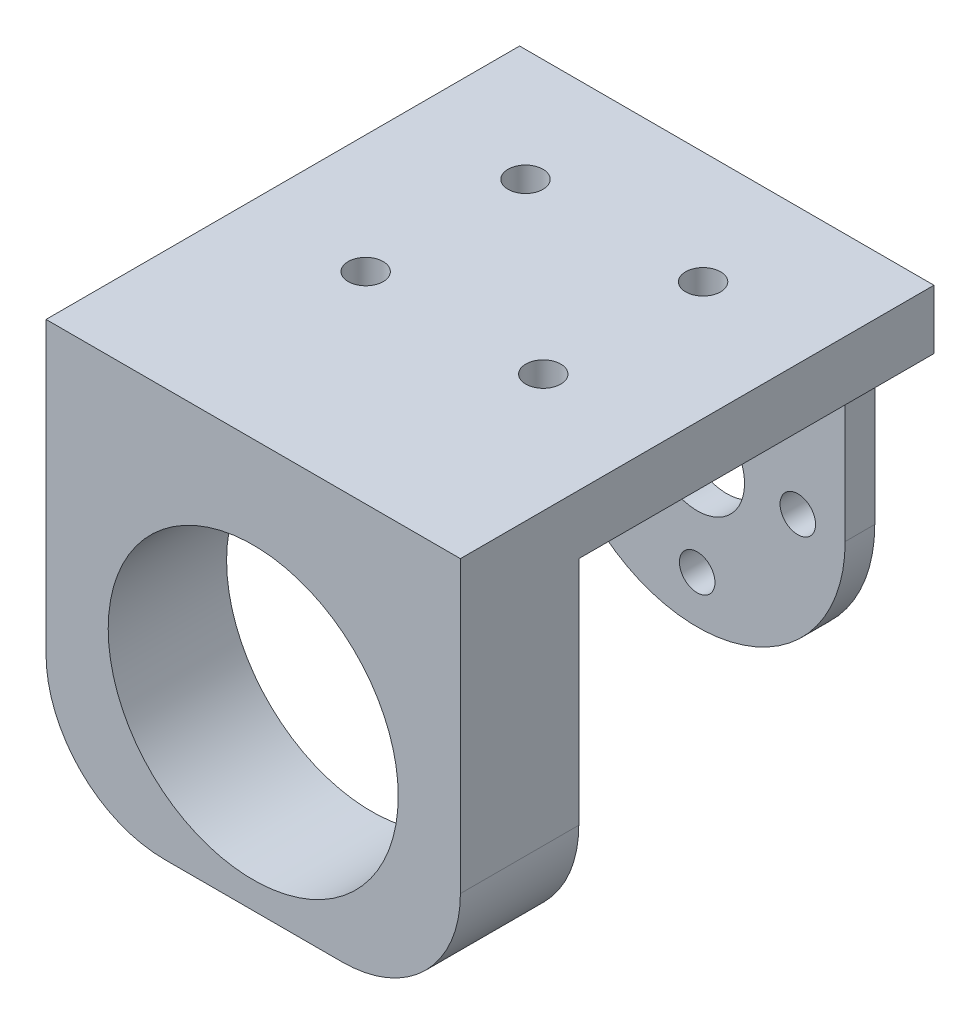
ISO-10303-21;
HEADER;
FILE_DESCRIPTION(('STEP AP214'),'2;1');
FILE_NAME('part.step','',(''),(''),'','','');
FILE_SCHEMA(('AUTOMOTIVE_DESIGN { 1 0 10303 214 1 1 1 1 }'));
ENDSEC;
DATA;
#1=APPLICATION_CONTEXT('core data for automotive mechanical design processes');
#2=APPLICATION_PROTOCOL_DEFINITION('international standard','automotive_design',2000,#1);
#3=PRODUCT_CONTEXT('',#1,'mechanical');
#4=PRODUCT('Part','Part','',(#3));
#5=PRODUCT_RELATED_PRODUCT_CATEGORY('part','',(#4));
#6=PRODUCT_DEFINITION_FORMATION('','',#4);
#7=PRODUCT_DEFINITION_CONTEXT('part definition',#1,'design');
#8=PRODUCT_DEFINITION('design','',#6,#7);
#9=PRODUCT_DEFINITION_SHAPE('','',#8);
#10=(LENGTH_UNIT() NAMED_UNIT(*) SI_UNIT(.MILLI.,.METRE.));
#11=(NAMED_UNIT(*) PLANE_ANGLE_UNIT() SI_UNIT($,.RADIAN.));
#12=(NAMED_UNIT(*) SI_UNIT($,.STERADIAN.) SOLID_ANGLE_UNIT());
#13=UNCERTAINTY_MEASURE_WITH_UNIT(LENGTH_MEASURE(1.E-05),#10,'distance_accuracy_value','');
#14=(GEOMETRIC_REPRESENTATION_CONTEXT(3) GLOBAL_UNCERTAINTY_ASSIGNED_CONTEXT((#13)) GLOBAL_UNIT_ASSIGNED_CONTEXT((#10,
#11,#12)) REPRESENTATION_CONTEXT('',''));
#15=CARTESIAN_POINT('',(0.,0.,0.));
#16=DIRECTION('',(0.,0.,1.));
#17=DIRECTION('',(1.,0.,0.));
#18=AXIS2_PLACEMENT_3D('',#15,#16,#17);
#19=CARTESIAN_POINT('',(-17.5,0.,40.));
#20=DIRECTION('',(-1.,0.,0.));
#21=DIRECTION('',(0.,0.,1.));
#22=AXIS2_PLACEMENT_3D('',#19,#20,#21);
#23=PLANE('',#22);
#24=DIRECTION('',(0.,1.,0.));
#25=VECTOR('',#24,1.);
#26=CARTESIAN_POINT('',(-17.5,-14.5,30.));
#27=LINE('',#26,#25);
#28=CARTESIAN_POINT('',(-17.5,-4.49999999999992,30.));
#29=VERTEX_POINT('',#28);
#30=CARTESIAN_POINT('',(-17.5,15.,30.));
#31=VERTEX_POINT('',#30);
#32=EDGE_CURVE('E160',#29,#31,#27,.T.);
#33=ORIENTED_EDGE('',*,*,#32,.F.);
#34=DIRECTION('',(0.,0.,-1.));
#35=VECTOR('',#34,1.);
#36=CARTESIAN_POINT('',(-17.5,-4.49999999999992,59.5));
#37=LINE('',#36,#35);
#38=CARTESIAN_POINT('',(-17.5,-4.49999999999992,40.));
#39=VERTEX_POINT('',#38);
#40=EDGE_CURVE('E146',#39,#29,#37,.T.);
#41=ORIENTED_EDGE('',*,*,#40,.F.);
#42=DIRECTION('',(0.,1.,0.));
#43=VECTOR('',#42,1.);
#44=CARTESIAN_POINT('',(-17.5,0.,40.));
#45=LINE('',#44,#43);
#46=CARTESIAN_POINT('',(-17.5,20.,40.));
#47=VERTEX_POINT('',#46);
#48=EDGE_CURVE('E186',#39,#47,#45,.T.);
#49=ORIENTED_EDGE('',*,*,#48,.T.);
#50=DIRECTION('',(0.,0.,-1.));
#51=VECTOR('',#50,1.);
#52=CARTESIAN_POINT('',(-17.5,20.,40.));
#53=LINE('',#52,#51);
#54=CARTESIAN_POINT('',(-17.5,20.,0.));
#55=VERTEX_POINT('',#54);
#56=EDGE_CURVE('E197',#47,#55,#53,.T.);
#57=ORIENTED_EDGE('',*,*,#56,.T.);
#58=DIRECTION('',(0.,1.,0.));
#59=VECTOR('',#58,1.);
#60=CARTESIAN_POINT('',(-17.5,0.,0.));
#61=LINE('',#60,#59);
#62=CARTESIAN_POINT('',(-17.5,15.,0.));
#63=VERTEX_POINT('',#62);
#64=EDGE_CURVE('E184',#63,#55,#61,.T.);
#65=ORIENTED_EDGE('',*,*,#64,.F.);
#66=DIRECTION('',(0.,0.,-1.));
#67=VECTOR('',#66,1.);
#68=CARTESIAN_POINT('',(-17.5,15.,40.));
#69=LINE('',#68,#67);
#70=EDGE_CURVE('E169',#31,#63,#69,.T.);
#71=ORIENTED_EDGE('',*,*,#70,.F.);
#72=EDGE_LOOP('',(#33,#41,#49,#57,#65,#71));
#73=FACE_BOUND('',#72,.T.);
#74=ADVANCED_FACE('F58',(#73),#23,.T.);
#75=CARTESIAN_POINT('',(17.5,0.,40.));
#76=DIRECTION('',(-1.,0.,0.));
#77=DIRECTION('',(0.,0.,1.));
#78=AXIS2_PLACEMENT_3D('',#75,#76,#77);
#79=PLANE('',#78);
#80=DIRECTION('',(0.,0.,-1.));
#81=VECTOR('',#80,1.);
#82=CARTESIAN_POINT('',(17.5,-4.49999999999992,59.5));
#83=LINE('',#82,#81);
#84=CARTESIAN_POINT('',(17.5,-4.49999999999992,40.));
#85=VERTEX_POINT('',#84);
#86=CARTESIAN_POINT('',(17.5,-4.49999999999992,30.));
#87=VERTEX_POINT('',#86);
#88=EDGE_CURVE('E165',#85,#87,#83,.T.);
#89=ORIENTED_EDGE('',*,*,#88,.T.);
#90=DIRECTION('',(0.,1.,0.));
#91=VECTOR('',#90,1.);
#92=CARTESIAN_POINT('',(17.5,-14.5,30.));
#93=LINE('',#92,#91);
#94=CARTESIAN_POINT('',(17.5,15.,30.));
#95=VERTEX_POINT('',#94);
#96=EDGE_CURVE('E170',#87,#95,#93,.T.);
#97=ORIENTED_EDGE('',*,*,#96,.T.);
#98=DIRECTION('',(0.,0.,-1.));
#99=VECTOR('',#98,1.);
#100=CARTESIAN_POINT('',(17.5,15.,40.));
#101=LINE('',#100,#99);
#102=CARTESIAN_POINT('',(17.5,15.,0.));
#103=VERTEX_POINT('',#102);
#104=EDGE_CURVE('E202',#95,#103,#101,.T.);
#105=ORIENTED_EDGE('',*,*,#104,.T.);
#106=DIRECTION('',(0.,1.,0.));
#107=VECTOR('',#106,1.);
#108=CARTESIAN_POINT('',(17.5,0.,0.));
#109=LINE('',#108,#107);
#110=CARTESIAN_POINT('',(17.5,20.,0.));
#111=VERTEX_POINT('',#110);
#112=EDGE_CURVE('E173',#103,#111,#109,.T.);
#113=ORIENTED_EDGE('',*,*,#112,.T.);
#114=DIRECTION('',(0.,0.,-1.));
#115=VECTOR('',#114,1.);
#116=CARTESIAN_POINT('',(17.5,20.,40.));
#117=LINE('',#116,#115);
#118=CARTESIAN_POINT('',(17.5,20.,40.));
#119=VERTEX_POINT('',#118);
#120=EDGE_CURVE('E188',#119,#111,#117,.T.);
#121=ORIENTED_EDGE('',*,*,#120,.F.);
#122=DIRECTION('',(0.,1.,0.));
#123=VECTOR('',#122,1.);
#124=CARTESIAN_POINT('',(17.5,0.,40.));
#125=LINE('',#124,#123);
#126=EDGE_CURVE('E183',#85,#119,#125,.T.);
#127=ORIENTED_EDGE('',*,*,#126,.F.);
#128=EDGE_LOOP('',(#89,#97,#105,#113,#121,#127));
#129=FACE_BOUND('',#128,.T.);
#130=ADVANCED_FACE('F291',(#129),#79,.F.);
#131=CARTESIAN_POINT('',(0.,-14.5,0.));
#132=DIRECTION('',(0.,1.,0.));
#133=DIRECTION('',(0.,0.,1.));
#134=AXIS2_PLACEMENT_3D('',#131,#132,#133);
#135=PLANE('',#134);
#136=DIRECTION('',(1.,0.,0.));
#137=VECTOR('',#136,1.);
#138=CARTESIAN_POINT('',(-17.5,-14.5,30.));
#139=LINE('',#138,#137);
#140=CARTESIAN_POINT('',(-7.49999999999994,-14.5,30.));
#141=VERTEX_POINT('',#140);
#142=CARTESIAN_POINT('',(7.49999999999993,-14.5,30.));
#143=VERTEX_POINT('',#142);
#144=EDGE_CURVE('E164',#141,#143,#139,.T.);
#145=ORIENTED_EDGE('',*,*,#144,.T.);
#146=DIRECTION('',(0.,0.,-1.));
#147=VECTOR('',#146,1.);
#148=CARTESIAN_POINT('',(7.5,-14.5,59.5));
#149=LINE('',#148,#147);
#150=CARTESIAN_POINT('',(7.5,-14.5,40.));
#151=VERTEX_POINT('',#150);
#152=EDGE_CURVE('E12',#143,#151,#149,.F.);
#153=ORIENTED_EDGE('',*,*,#152,.T.);
#154=DIRECTION('',(1.,0.,0.));
#155=VECTOR('',#154,1.);
#156=CARTESIAN_POINT('',(-17.5,-14.5,40.));
#157=LINE('',#156,#155);
#158=CARTESIAN_POINT('',(-7.49999999999994,-14.5,40.));
#159=VERTEX_POINT('',#158);
#160=EDGE_CURVE('E171',#159,#151,#157,.T.);
#161=ORIENTED_EDGE('',*,*,#160,.F.);
#162=DIRECTION('',(0.,0.,-1.));
#163=VECTOR('',#162,1.);
#164=CARTESIAN_POINT('',(-7.50000000000001,-14.5,59.5));
#165=LINE('',#164,#163);
#166=EDGE_CURVE('E67',#141,#159,#165,.F.);
#167=ORIENTED_EDGE('',*,*,#166,.F.);
#168=EDGE_LOOP('',(#145,#153,#161,#167));
#169=FACE_BOUND('',#168,.T.);
#170=ADVANCED_FACE('F305',(#169),#135,.F.);
#171=CARTESIAN_POINT('',(0.,15.,40.));
#172=DIRECTION('',(0.,-1.,0.));
#173=DIRECTION('',(0.,0.,-1.));
#174=AXIS2_PLACEMENT_3D('',#171,#172,#173);
#175=PLANE('',#174);
#176=CARTESIAN_POINT('',(-7.50000000000001,15.,23.));
#177=DIRECTION('',(0.,-1.,0.));
#178=DIRECTION('',(0.,0.,-1.));
#179=AXIS2_PLACEMENT_3D('',#176,#177,#178);
#180=CIRCLE('',#179,1.475);
#181=CARTESIAN_POINT('',(-7.50000000000001,15.,21.525));
#182=VERTEX_POINT('',#181);
#183=EDGE_CURVE('E545',#182,#182,#180,.T.);
#184=ORIENTED_EDGE('',*,*,#183,.F.);
#185=EDGE_LOOP('',(#184));
#186=FACE_BOUND('',#185,.T.);
#187=CARTESIAN_POINT('',(-7.5,15.,9.5));
#188=DIRECTION('',(0.,-1.,0.));
#189=DIRECTION('',(0.,0.,-1.));
#190=AXIS2_PLACEMENT_3D('',#187,#188,#189);
#191=CIRCLE('',#190,1.475);
#192=CARTESIAN_POINT('',(-7.5,15.,8.025));
#193=VERTEX_POINT('',#192);
#194=EDGE_CURVE('E549',#193,#193,#191,.T.);
#195=ORIENTED_EDGE('',*,*,#194,.F.);
#196=EDGE_LOOP('',(#195));
#197=FACE_BOUND('',#196,.T.);
#198=CARTESIAN_POINT('',(7.5,15.,9.5));
#199=DIRECTION('',(0.,-1.,0.));
#200=DIRECTION('',(0.,0.,-1.));
#201=AXIS2_PLACEMENT_3D('',#198,#199,#200);
#202=CIRCLE('',#201,1.475);
#203=CARTESIAN_POINT('',(7.5,15.,8.025));
#204=VERTEX_POINT('',#203);
#205=EDGE_CURVE('E546',#204,#204,#202,.T.);
#206=ORIENTED_EDGE('',*,*,#205,.F.);
#207=EDGE_LOOP('',(#206));
#208=FACE_BOUND('',#207,.T.);
#209=CARTESIAN_POINT('',(7.5,15.,23.));
#210=DIRECTION('',(0.,-1.,0.));
#211=DIRECTION('',(0.,0.,-1.));
#212=AXIS2_PLACEMENT_3D('',#209,#210,#211);
#213=CIRCLE('',#212,1.475);
#214=CARTESIAN_POINT('',(7.5,15.,21.525));
#215=VERTEX_POINT('',#214);
#216=EDGE_CURVE('E246',#215,#215,#213,.T.);
#217=ORIENTED_EDGE('',*,*,#216,.F.);
#218=EDGE_LOOP('',(#217));
#219=FACE_BOUND('',#218,.T.);
#220=ORIENTED_EDGE('',*,*,#104,.F.);
#221=DIRECTION('',(1.,0.,0.));
#222=VECTOR('',#221,1.);
#223=CARTESIAN_POINT('',(-17.5,15.,30.));
#224=LINE('',#223,#222);
#225=EDGE_CURVE('E178',#31,#95,#224,.T.);
#226=ORIENTED_EDGE('',*,*,#225,.F.);
#227=ORIENTED_EDGE('',*,*,#70,.T.);
#228=DIRECTION('',(-1.,0.,0.));
#229=VECTOR('',#228,1.);
#230=CARTESIAN_POINT('',(0.,15.,0.));
#231=LINE('',#230,#229);
#232=CARTESIAN_POINT('',(-12.5,15.,0.));
#233=VERTEX_POINT('',#232);
#234=EDGE_CURVE('E191',#233,#63,#231,.T.);
#235=ORIENTED_EDGE('',*,*,#234,.F.);
#236=DIRECTION('',(0.,0.,-1.));
#237=VECTOR('',#236,1.);
#238=CARTESIAN_POINT('',(-12.5,15.,2.5));
#239=LINE('',#238,#237);
#240=CARTESIAN_POINT('',(-12.5,15.,2.5));
#241=VERTEX_POINT('',#240);
#242=EDGE_CURVE('E211',#241,#233,#239,.T.);
#243=ORIENTED_EDGE('',*,*,#242,.F.);
#244=DIRECTION('',(1.,0.,0.));
#245=VECTOR('',#244,1.);
#246=CARTESIAN_POINT('',(0.,15.,2.5));
#247=LINE('',#246,#245);
#248=CARTESIAN_POINT('',(12.5,15.,2.5));
#249=VERTEX_POINT('',#248);
#250=EDGE_CURVE('E200',#241,#249,#247,.T.);
#251=ORIENTED_EDGE('',*,*,#250,.T.);
#252=DIRECTION('',(0.,0.,-1.));
#253=VECTOR('',#252,1.);
#254=CARTESIAN_POINT('',(12.5,15.,2.5));
#255=LINE('',#254,#253);
#256=CARTESIAN_POINT('',(12.5,15.,0.));
#257=VERTEX_POINT('',#256);
#258=EDGE_CURVE('E208',#249,#257,#255,.T.);
#259=ORIENTED_EDGE('',*,*,#258,.T.);
#260=EDGE_CURVE('E192',#103,#257,#231,.T.);
#261=ORIENTED_EDGE('',*,*,#260,.F.);
#262=EDGE_LOOP('',(#220,#226,#227,#235,#243,#251,#259,#261));
#263=FACE_BOUND('',#262,.T.);
#264=ADVANCED_FACE('F285',(#186,#197,#208,#219,#263),#175,.T.);
#265=CARTESIAN_POINT('',(-12.5,0.,2.5));
#266=DIRECTION('',(1.,0.,0.));
#267=DIRECTION('',(0.,1.,0.));
#268=AXIS2_PLACEMENT_3D('',#265,#266,#267);
#269=PLANE('',#268);
#270=DIRECTION('',(0.,-1.,0.));
#271=VECTOR('',#270,1.);
#272=CARTESIAN_POINT('',(-12.5,0.,2.5));
#273=LINE('',#272,#271);
#274=CARTESIAN_POINT('',(-12.5,0.,2.5));
#275=VERTEX_POINT('',#274);
#276=EDGE_CURVE('E214',#241,#275,#273,.T.);
#277=ORIENTED_EDGE('',*,*,#276,.F.);
#278=ORIENTED_EDGE('',*,*,#242,.T.);
#279=DIRECTION('',(0.,-1.,0.));
#280=VECTOR('',#279,1.);
#281=CARTESIAN_POINT('',(-12.5,0.,0.));
#282=LINE('',#281,#280);
#283=CARTESIAN_POINT('',(-12.5,0.,0.));
#284=VERTEX_POINT('',#283);
#285=EDGE_CURVE('E213',#233,#284,#282,.T.);
#286=ORIENTED_EDGE('',*,*,#285,.T.);
#287=DIRECTION('',(0.,0.,-1.));
#288=VECTOR('',#287,1.);
#289=CARTESIAN_POINT('',(-12.5,0.,2.5));
#290=LINE('',#289,#288);
#291=EDGE_CURVE('E238',#275,#284,#290,.T.);
#292=ORIENTED_EDGE('',*,*,#291,.F.);
#293=EDGE_LOOP('',(#277,#278,#286,#292));
#294=FACE_BOUND('',#293,.T.);
#295=ADVANCED_FACE('F60',(#294),#269,.F.);
#296=CARTESIAN_POINT('',(0.,0.,2.5));
#297=DIRECTION('',(0.,0.,-1.));
#298=DIRECTION('',(-1.,0.,0.));
#299=AXIS2_PLACEMENT_3D('',#296,#297,#298);
#300=CYLINDRICAL_SURFACE('',#299,12.5);
#301=CARTESIAN_POINT('',(0.,0.,0.));
#302=DIRECTION('',(0.,0.,1.));
#303=DIRECTION('',(1.,0.,0.));
#304=AXIS2_PLACEMENT_3D('',#301,#302,#303);
#305=CIRCLE('',#304,12.5);
#306=CARTESIAN_POINT('',(12.5,0.,0.));
#307=VERTEX_POINT('',#306);
#308=EDGE_CURVE('E227',#284,#307,#305,.T.);
#309=ORIENTED_EDGE('',*,*,#308,.T.);
#310=DIRECTION('',(0.,0.,-1.));
#311=VECTOR('',#310,1.);
#312=CARTESIAN_POINT('',(12.5,0.,2.5));
#313=LINE('',#312,#311);
#314=CARTESIAN_POINT('',(12.5,0.,2.5));
#315=VERTEX_POINT('',#314);
#316=EDGE_CURVE('E225',#315,#307,#313,.T.);
#317=ORIENTED_EDGE('',*,*,#316,.F.);
#318=CARTESIAN_POINT('',(0.,0.,2.5));
#319=DIRECTION('',(0.,0.,1.));
#320=DIRECTION('',(1.,0.,0.));
#321=AXIS2_PLACEMENT_3D('',#318,#319,#320);
#322=CIRCLE('',#321,12.5);
#323=EDGE_CURVE('E216',#275,#315,#322,.T.);
#324=ORIENTED_EDGE('',*,*,#323,.F.);
#325=ORIENTED_EDGE('',*,*,#291,.T.);
#326=EDGE_LOOP('',(#309,#317,#324,#325));
#327=FACE_BOUND('',#326,.T.);
#328=ADVANCED_FACE('F346',(#327),#300,.T.);
#329=CARTESIAN_POINT('',(12.5,0.,2.5));
#330=DIRECTION('',(1.,0.,0.));
#331=DIRECTION('',(0.,1.,0.));
#332=AXIS2_PLACEMENT_3D('',#329,#330,#331);
#333=PLANE('',#332);
#334=ORIENTED_EDGE('',*,*,#258,.F.);
#335=DIRECTION('',(0.,-1.,0.));
#336=VECTOR('',#335,1.);
#337=CARTESIAN_POINT('',(12.5,0.,2.5));
#338=LINE('',#337,#336);
#339=EDGE_CURVE('E220',#249,#315,#338,.T.);
#340=ORIENTED_EDGE('',*,*,#339,.T.);
#341=ORIENTED_EDGE('',*,*,#316,.T.);
#342=DIRECTION('',(0.,-1.,0.));
#343=VECTOR('',#342,1.);
#344=CARTESIAN_POINT('',(12.5,0.,0.));
#345=LINE('',#344,#343);
#346=EDGE_CURVE('E230',#257,#307,#345,.T.);
#347=ORIENTED_EDGE('',*,*,#346,.F.);
#348=EDGE_LOOP('',(#334,#340,#341,#347));
#349=FACE_BOUND('',#348,.T.);
#350=ADVANCED_FACE('F343',(#349),#333,.T.);
#351=CARTESIAN_POINT('',(0.,20.,2.5));
#352=DIRECTION('',(0.,1.,0.));
#353=DIRECTION('',(0.,0.,1.));
#354=AXIS2_PLACEMENT_3D('',#351,#352,#353);
#355=PLANE('',#354);
#356=CARTESIAN_POINT('',(-7.50000000000001,20.,23.));
#357=DIRECTION('',(0.,1.,0.));
#358=DIRECTION('',(0.,0.,1.));
#359=AXIS2_PLACEMENT_3D('',#356,#357,#358);
#360=CIRCLE('',#359,1.475);
#361=CARTESIAN_POINT('',(-7.50000000000001,20.,24.475));
#362=VERTEX_POINT('',#361);
#363=EDGE_CURVE('E62',#362,#362,#360,.T.);
#364=ORIENTED_EDGE('',*,*,#363,.F.);
#365=EDGE_LOOP('',(#364));
#366=FACE_BOUND('',#365,.T.);
#367=CARTESIAN_POINT('',(-7.5,20.,9.5));
#368=DIRECTION('',(0.,1.,0.));
#369=DIRECTION('',(0.,0.,1.));
#370=AXIS2_PLACEMENT_3D('',#367,#368,#369);
#371=CIRCLE('',#370,1.475);
#372=CARTESIAN_POINT('',(-7.5,20.,10.975));
#373=VERTEX_POINT('',#372);
#374=EDGE_CURVE('E248',#373,#373,#371,.T.);
#375=ORIENTED_EDGE('',*,*,#374,.F.);
#376=EDGE_LOOP('',(#375));
#377=FACE_BOUND('',#376,.T.);
#378=CARTESIAN_POINT('',(7.5,20.,9.5));
#379=DIRECTION('',(0.,1.,0.));
#380=DIRECTION('',(0.,0.,1.));
#381=AXIS2_PLACEMENT_3D('',#378,#379,#380);
#382=CIRCLE('',#381,1.475);
#383=CARTESIAN_POINT('',(7.5,20.,10.975));
#384=VERTEX_POINT('',#383);
#385=EDGE_CURVE('E245',#384,#384,#382,.T.);
#386=ORIENTED_EDGE('',*,*,#385,.F.);
#387=EDGE_LOOP('',(#386));
#388=FACE_BOUND('',#387,.T.);
#389=CARTESIAN_POINT('',(7.5,20.,23.));
#390=DIRECTION('',(0.,1.,0.));
#391=DIRECTION('',(0.,0.,1.));
#392=AXIS2_PLACEMENT_3D('',#389,#390,#391);
#393=CIRCLE('',#392,1.475);
#394=CARTESIAN_POINT('',(7.5,20.,24.475));
#395=VERTEX_POINT('',#394);
#396=EDGE_CURVE('E242',#395,#395,#393,.T.);
#397=ORIENTED_EDGE('',*,*,#396,.F.);
#398=EDGE_LOOP('',(#397));
#399=FACE_BOUND('',#398,.T.);
#400=DIRECTION('',(1.,0.,0.));
#401=VECTOR('',#400,1.);
#402=CARTESIAN_POINT('',(0.,20.,0.));
#403=LINE('',#402,#401);
#404=EDGE_CURVE('E232',#55,#111,#403,.T.);
#405=ORIENTED_EDGE('',*,*,#404,.F.);
#406=ORIENTED_EDGE('',*,*,#56,.F.);
#407=DIRECTION('',(1.,0.,0.));
#408=VECTOR('',#407,1.);
#409=CARTESIAN_POINT('',(0.,20.,40.));
#410=LINE('',#409,#408);
#411=EDGE_CURVE('E180',#47,#119,#410,.T.);
#412=ORIENTED_EDGE('',*,*,#411,.T.);
#413=ORIENTED_EDGE('',*,*,#120,.T.);
#414=EDGE_LOOP('',(#405,#406,#412,#413));
#415=FACE_BOUND('',#414,.T.);
#416=ADVANCED_FACE('F299',(#366,#377,#388,#399,#415),#355,.T.);
#417=CARTESIAN_POINT('',(0.,0.,2.5));
#418=DIRECTION('',(0.,0.,-1.));
#419=DIRECTION('',(-1.,0.,0.));
#420=AXIS2_PLACEMENT_3D('',#417,#418,#419);
#421=CYLINDRICAL_SURFACE('',#420,4.);
#422=CARTESIAN_POINT('',(0.,0.,2.5));
#423=DIRECTION('',(0.,0.,1.));
#424=DIRECTION('',(1.,0.,0.));
#425=AXIS2_PLACEMENT_3D('',#422,#423,#424);
#426=CIRCLE('',#425,4.);
#427=CARTESIAN_POINT('',(4.,0.,2.5));
#428=VERTEX_POINT('',#427);
#429=EDGE_CURVE('E222',#428,#428,#426,.T.);
#430=ORIENTED_EDGE('',*,*,#429,.T.);
#431=EDGE_LOOP('',(#430));
#432=FACE_BOUND('',#431,.T.);
#433=CARTESIAN_POINT('',(0.,0.,0.));
#434=DIRECTION('',(0.,0.,1.));
#435=DIRECTION('',(1.,0.,0.));
#436=AXIS2_PLACEMENT_3D('',#433,#434,#435);
#437=CIRCLE('',#436,4.);
#438=CARTESIAN_POINT('',(4.,0.,0.));
#439=VERTEX_POINT('',#438);
#440=EDGE_CURVE('E217',#439,#439,#437,.T.);
#441=ORIENTED_EDGE('',*,*,#440,.F.);
#442=EDGE_LOOP('',(#441));
#443=FACE_BOUND('',#442,.T.);
#444=ADVANCED_FACE('F333',(#432,#443),#421,.F.);
#445=CARTESIAN_POINT('',(0.,0.,2.5));
#446=DIRECTION('',(0.,0.,1.));
#447=DIRECTION('',(1.,0.,0.));
#448=AXIS2_PLACEMENT_3D('',#445,#446,#447);
#449=PLANE('',#448);
#450=CARTESIAN_POINT('',(8.5,0.,2.5));
#451=DIRECTION('',(0.,0.,1.));
#452=DIRECTION('',(1.,0.,0.));
#453=AXIS2_PLACEMENT_3D('',#450,#451,#452);
#454=CIRCLE('',#453,1.5);
#455=CARTESIAN_POINT('',(10.,0.,2.5));
#456=VERTEX_POINT('',#455);
#457=EDGE_CURVE('E532',#456,#456,#454,.T.);
#458=ORIENTED_EDGE('',*,*,#457,.F.);
#459=EDGE_LOOP('',(#458));
#460=FACE_BOUND('',#459,.T.);
#461=CARTESIAN_POINT('',(-8.5,0.,2.5));
#462=DIRECTION('',(0.,0.,1.));
#463=DIRECTION('',(1.,0.,0.));
#464=AXIS2_PLACEMENT_3D('',#461,#462,#463);
#465=CIRCLE('',#464,1.5);
#466=CARTESIAN_POINT('',(-7.,0.,2.5));
#467=VERTEX_POINT('',#466);
#468=EDGE_CURVE('E536',#467,#467,#465,.T.);
#469=ORIENTED_EDGE('',*,*,#468,.F.);
#470=EDGE_LOOP('',(#469));
#471=FACE_BOUND('',#470,.T.);
#472=CARTESIAN_POINT('',(0.,8.5,2.5));
#473=DIRECTION('',(0.,0.,1.));
#474=DIRECTION('',(1.,0.,0.));
#475=AXIS2_PLACEMENT_3D('',#472,#473,#474);
#476=CIRCLE('',#475,1.5);
#477=CARTESIAN_POINT('',(1.5,8.5,2.5));
#478=VERTEX_POINT('',#477);
#479=EDGE_CURVE('E268',#478,#478,#476,.T.);
#480=ORIENTED_EDGE('',*,*,#479,.F.);
#481=EDGE_LOOP('',(#480));
#482=FACE_BOUND('',#481,.T.);
#483=CARTESIAN_POINT('',(0.,-8.5,2.5));
#484=DIRECTION('',(0.,0.,1.));
#485=DIRECTION('',(1.,0.,0.));
#486=AXIS2_PLACEMENT_3D('',#483,#484,#485);
#487=CIRCLE('',#486,1.5);
#488=CARTESIAN_POINT('',(1.5,-8.5,2.5));
#489=VERTEX_POINT('',#488);
#490=EDGE_CURVE('E262',#489,#489,#487,.T.);
#491=ORIENTED_EDGE('',*,*,#490,.F.);
#492=EDGE_LOOP('',(#491));
#493=FACE_BOUND('',#492,.T.);
#494=ORIENTED_EDGE('',*,*,#250,.F.);
#495=ORIENTED_EDGE('',*,*,#276,.T.);
#496=ORIENTED_EDGE('',*,*,#323,.T.);
#497=ORIENTED_EDGE('',*,*,#339,.F.);
#498=EDGE_LOOP('',(#494,#495,#496,#497));
#499=FACE_BOUND('',#498,.T.);
#500=ORIENTED_EDGE('',*,*,#429,.F.);
#501=EDGE_LOOP('',(#500));
#502=FACE_BOUND('',#501,.T.);
#503=ADVANCED_FACE('F330',(#460,#471,#482,#493,#499,#502),#449,.T.);
#504=CARTESIAN_POINT('',(0.,0.,0.));
#505=DIRECTION('',(0.,0.,1.));
#506=DIRECTION('',(1.,0.,0.));
#507=AXIS2_PLACEMENT_3D('',#504,#505,#506);
#508=PLANE('',#507);
#509=CARTESIAN_POINT('',(8.5,0.,0.));
#510=DIRECTION('',(0.,0.,-1.));
#511=DIRECTION('',(-1.,0.,0.));
#512=AXIS2_PLACEMENT_3D('',#509,#510,#511);
#513=CIRCLE('',#512,1.5);
#514=CARTESIAN_POINT('',(7.,0.,0.));
#515=VERTEX_POINT('',#514);
#516=EDGE_CURVE('E535',#515,#515,#513,.T.);
#517=ORIENTED_EDGE('',*,*,#516,.F.);
#518=EDGE_LOOP('',(#517));
#519=FACE_BOUND('',#518,.T.);
#520=CARTESIAN_POINT('',(-8.5,0.,0.));
#521=DIRECTION('',(0.,0.,-1.));
#522=DIRECTION('',(-1.,0.,0.));
#523=AXIS2_PLACEMENT_3D('',#520,#521,#522);
#524=CIRCLE('',#523,1.5);
#525=CARTESIAN_POINT('',(-10.,0.,0.));
#526=VERTEX_POINT('',#525);
#527=EDGE_CURVE('E537',#526,#526,#524,.T.);
#528=ORIENTED_EDGE('',*,*,#527,.F.);
#529=EDGE_LOOP('',(#528));
#530=FACE_BOUND('',#529,.T.);
#531=CARTESIAN_POINT('',(0.,8.5,0.));
#532=DIRECTION('',(0.,0.,-1.));
#533=DIRECTION('',(-1.,0.,0.));
#534=AXIS2_PLACEMENT_3D('',#531,#532,#533);
#535=CIRCLE('',#534,1.5);
#536=CARTESIAN_POINT('',(-1.5,8.5,0.));
#537=VERTEX_POINT('',#536);
#538=EDGE_CURVE('E257',#537,#537,#535,.T.);
#539=ORIENTED_EDGE('',*,*,#538,.F.);
#540=EDGE_LOOP('',(#539));
#541=FACE_BOUND('',#540,.T.);
#542=CARTESIAN_POINT('',(0.,-8.5,0.));
#543=DIRECTION('',(0.,0.,-1.));
#544=DIRECTION('',(-1.,0.,0.));
#545=AXIS2_PLACEMENT_3D('',#542,#543,#544);
#546=CIRCLE('',#545,1.5);
#547=CARTESIAN_POINT('',(-1.5,-8.5,0.));
#548=VERTEX_POINT('',#547);
#549=EDGE_CURVE('E253',#548,#548,#546,.T.);
#550=ORIENTED_EDGE('',*,*,#549,.F.);
#551=EDGE_LOOP('',(#550));
#552=FACE_BOUND('',#551,.T.);
#553=ORIENTED_EDGE('',*,*,#285,.F.);
#554=ORIENTED_EDGE('',*,*,#234,.T.);
#555=ORIENTED_EDGE('',*,*,#64,.T.);
#556=ORIENTED_EDGE('',*,*,#404,.T.);
#557=ORIENTED_EDGE('',*,*,#112,.F.);
#558=ORIENTED_EDGE('',*,*,#260,.T.);
#559=ORIENTED_EDGE('',*,*,#346,.T.);
#560=ORIENTED_EDGE('',*,*,#308,.F.);
#561=EDGE_LOOP('',(#553,#554,#555,#556,#557,#558,#559,#560));
#562=FACE_BOUND('',#561,.T.);
#563=ORIENTED_EDGE('',*,*,#440,.T.);
#564=EDGE_LOOP('',(#563));
#565=FACE_BOUND('',#564,.T.);
#566=ADVANCED_FACE('F295',(#519,#530,#541,#552,#562,#565),#508,.F.);
#567=CARTESIAN_POINT('',(0.,0.,40.));
#568=DIRECTION('',(0.,0.,-1.));
#569=DIRECTION('',(-1.,0.,0.));
#570=AXIS2_PLACEMENT_3D('',#567,#568,#569);
#571=PLANE('',#570);
#572=CARTESIAN_POINT('',(0.,0.,40.));
#573=DIRECTION('',(0.,0.,-1.));
#574=DIRECTION('',(-1.,0.,0.));
#575=AXIS2_PLACEMENT_3D('',#572,#573,#574);
#576=CIRCLE('',#575,12.25);
#577=CARTESIAN_POINT('',(-12.25,0.,40.));
#578=VERTEX_POINT('',#577);
#579=EDGE_CURVE('E279',#578,#578,#576,.T.);
#580=ORIENTED_EDGE('',*,*,#579,.T.);
#581=EDGE_LOOP('',(#580));
#582=FACE_BOUND('',#581,.T.);
#583=ORIENTED_EDGE('',*,*,#160,.T.);
#584=CARTESIAN_POINT('',(7.5,-4.5,40.));
#585=DIRECTION('',(0.,0.,-1.));
#586=DIRECTION('',(-1.,0.,0.));
#587=AXIS2_PLACEMENT_3D('',#584,#585,#586);
#588=CIRCLE('',#587,10.);
#589=EDGE_CURVE('E75',#151,#85,#588,.F.);
#590=ORIENTED_EDGE('',*,*,#589,.T.);
#591=ORIENTED_EDGE('',*,*,#126,.T.);
#592=ORIENTED_EDGE('',*,*,#411,.F.);
#593=ORIENTED_EDGE('',*,*,#48,.F.);
#594=CARTESIAN_POINT('',(-7.50000000000001,-4.5,40.));
#595=DIRECTION('',(0.,0.,-1.));
#596=DIRECTION('',(-1.,0.,0.));
#597=AXIS2_PLACEMENT_3D('',#594,#595,#596);
#598=CIRCLE('',#597,10.);
#599=EDGE_CURVE('E149',#39,#159,#598,.F.);
#600=ORIENTED_EDGE('',*,*,#599,.T.);
#601=EDGE_LOOP('',(#583,#590,#591,#592,#593,#600));
#602=FACE_BOUND('',#601,.T.);
#603=ADVANCED_FACE('F303',(#582,#602),#571,.F.);
#604=CARTESIAN_POINT('',(-17.5,-14.5,30.));
#605=DIRECTION('',(0.,0.,1.));
#606=DIRECTION('',(1.,0.,0.));
#607=AXIS2_PLACEMENT_3D('',#604,#605,#606);
#608=PLANE('',#607);
#609=CARTESIAN_POINT('',(0.,0.,30.));
#610=DIRECTION('',(0.,0.,-1.));
#611=DIRECTION('',(-1.,0.,0.));
#612=AXIS2_PLACEMENT_3D('',#609,#610,#611);
#613=CIRCLE('',#612,12.25);
#614=CARTESIAN_POINT('',(-12.25,0.,30.));
#615=VERTEX_POINT('',#614);
#616=EDGE_CURVE('E153',#615,#615,#613,.T.);
#617=ORIENTED_EDGE('',*,*,#616,.F.);
#618=EDGE_LOOP('',(#617));
#619=FACE_BOUND('',#618,.T.);
#620=ORIENTED_EDGE('',*,*,#96,.F.);
#621=CARTESIAN_POINT('',(7.5,-4.5,30.));
#622=DIRECTION('',(0.,0.,-1.));
#623=DIRECTION('',(-1.,0.,0.));
#624=AXIS2_PLACEMENT_3D('',#621,#622,#623);
#625=CIRCLE('',#624,10.);
#626=EDGE_CURVE('E270',#143,#87,#625,.F.);
#627=ORIENTED_EDGE('',*,*,#626,.F.);
#628=ORIENTED_EDGE('',*,*,#144,.F.);
#629=CARTESIAN_POINT('',(-7.50000000000001,-4.5,30.));
#630=DIRECTION('',(0.,0.,-1.));
#631=DIRECTION('',(-1.,0.,0.));
#632=AXIS2_PLACEMENT_3D('',#629,#630,#631);
#633=CIRCLE('',#632,10.);
#634=EDGE_CURVE('E82',#29,#141,#633,.F.);
#635=ORIENTED_EDGE('',*,*,#634,.F.);
#636=ORIENTED_EDGE('',*,*,#32,.T.);
#637=ORIENTED_EDGE('',*,*,#225,.T.);
#638=EDGE_LOOP('',(#620,#627,#628,#635,#636,#637));
#639=FACE_BOUND('',#638,.T.);
#640=ADVANCED_FACE('F158',(#619,#639),#608,.F.);
#641=CARTESIAN_POINT('',(-7.50000000000001,-4.5,59.5));
#642=DIRECTION('',(0.,0.,-1.));
#643=DIRECTION('',(-1.,0.,0.));
#644=AXIS2_PLACEMENT_3D('',#641,#642,#643);
#645=CYLINDRICAL_SURFACE('',#644,10.);
#646=ORIENTED_EDGE('',*,*,#40,.T.);
#647=ORIENTED_EDGE('',*,*,#634,.T.);
#648=ORIENTED_EDGE('',*,*,#166,.T.);
#649=ORIENTED_EDGE('',*,*,#599,.F.);
#650=EDGE_LOOP('',(#646,#647,#648,#649));
#651=FACE_BOUND('',#650,.T.);
#652=ADVANCED_FACE('F147',(#651),#645,.T.);
#653=CARTESIAN_POINT('',(7.5,-4.5,59.5));
#654=DIRECTION('',(0.,0.,-1.));
#655=DIRECTION('',(-1.,0.,0.));
#656=AXIS2_PLACEMENT_3D('',#653,#654,#655);
#657=CYLINDRICAL_SURFACE('',#656,10.);
#658=ORIENTED_EDGE('',*,*,#152,.F.);
#659=ORIENTED_EDGE('',*,*,#626,.T.);
#660=ORIENTED_EDGE('',*,*,#88,.F.);
#661=ORIENTED_EDGE('',*,*,#589,.F.);
#662=EDGE_LOOP('',(#658,#659,#660,#661));
#663=FACE_BOUND('',#662,.T.);
#664=ADVANCED_FACE('F306',(#663),#657,.T.);
#665=CARTESIAN_POINT('',(0.,0.,59.5));
#666=DIRECTION('',(0.,0.,-1.));
#667=DIRECTION('',(-1.,0.,0.));
#668=AXIS2_PLACEMENT_3D('',#665,#666,#667);
#669=CYLINDRICAL_SURFACE('',#668,12.25);
#670=ORIENTED_EDGE('',*,*,#616,.T.);
#671=EDGE_LOOP('',(#670));
#672=FACE_BOUND('',#671,.T.);
#673=ORIENTED_EDGE('',*,*,#579,.F.);
#674=EDGE_LOOP('',(#673));
#675=FACE_BOUND('',#674,.T.);
#676=ADVANCED_FACE('F308',(#672,#675),#669,.F.);
#677=CARTESIAN_POINT('',(0.,-8.5,29.5));
#678=DIRECTION('',(0.,0.,-1.));
#679=DIRECTION('',(-1.,0.,0.));
#680=AXIS2_PLACEMENT_3D('',#677,#678,#679);
#681=CYLINDRICAL_SURFACE('',#680,1.5);
#682=ORIENTED_EDGE('',*,*,#490,.T.);
#683=EDGE_LOOP('',(#682));
#684=FACE_BOUND('',#683,.T.);
#685=ORIENTED_EDGE('',*,*,#549,.T.);
#686=EDGE_LOOP('',(#685));
#687=FACE_BOUND('',#686,.T.);
#688=ADVANCED_FACE('F314',(#684,#687),#681,.F.);
#689=CARTESIAN_POINT('',(0.,8.5,29.5));
#690=DIRECTION('',(0.,0.,-1.));
#691=DIRECTION('',(-1.,0.,0.));
#692=AXIS2_PLACEMENT_3D('',#689,#690,#691);
#693=CYLINDRICAL_SURFACE('',#692,1.5);
#694=ORIENTED_EDGE('',*,*,#479,.T.);
#695=EDGE_LOOP('',(#694));
#696=FACE_BOUND('',#695,.T.);
#697=ORIENTED_EDGE('',*,*,#538,.T.);
#698=EDGE_LOOP('',(#697));
#699=FACE_BOUND('',#698,.T.);
#700=ADVANCED_FACE('F460',(#696,#699),#693,.F.);
#701=CARTESIAN_POINT('',(7.5,25.,23.));
#702=DIRECTION('',(0.,-1.,0.));
#703=DIRECTION('',(0.,0.,-1.));
#704=AXIS2_PLACEMENT_3D('',#701,#702,#703);
#705=CYLINDRICAL_SURFACE('',#704,1.475);
#706=ORIENTED_EDGE('',*,*,#396,.T.);
#707=EDGE_LOOP('',(#706));
#708=FACE_BOUND('',#707,.T.);
#709=ORIENTED_EDGE('',*,*,#216,.T.);
#710=EDGE_LOOP('',(#709));
#711=FACE_BOUND('',#710,.T.);
#712=ADVANCED_FACE('F469',(#708,#711),#705,.F.);
#713=CARTESIAN_POINT('',(7.5,25.,9.5));
#714=DIRECTION('',(0.,-1.,0.));
#715=DIRECTION('',(0.,0.,-1.));
#716=AXIS2_PLACEMENT_3D('',#713,#714,#715);
#717=CYLINDRICAL_SURFACE('',#716,1.475);
#718=ORIENTED_EDGE('',*,*,#385,.T.);
#719=EDGE_LOOP('',(#718));
#720=FACE_BOUND('',#719,.T.);
#721=ORIENTED_EDGE('',*,*,#205,.T.);
#722=EDGE_LOOP('',(#721));
#723=FACE_BOUND('',#722,.T.);
#724=ADVANCED_FACE('F479',(#720,#723),#717,.F.);
#725=CARTESIAN_POINT('',(-7.5,25.,9.5));
#726=DIRECTION('',(0.,-1.,0.));
#727=DIRECTION('',(0.,0.,-1.));
#728=AXIS2_PLACEMENT_3D('',#725,#726,#727);
#729=CYLINDRICAL_SURFACE('',#728,1.475);
#730=ORIENTED_EDGE('',*,*,#374,.T.);
#731=EDGE_LOOP('',(#730));
#732=FACE_BOUND('',#731,.T.);
#733=ORIENTED_EDGE('',*,*,#194,.T.);
#734=EDGE_LOOP('',(#733));
#735=FACE_BOUND('',#734,.T.);
#736=ADVANCED_FACE('F486',(#732,#735),#729,.F.);
#737=CARTESIAN_POINT('',(-7.50000000000001,25.,23.));
#738=DIRECTION('',(0.,-1.,0.));
#739=DIRECTION('',(0.,0.,-1.));
#740=AXIS2_PLACEMENT_3D('',#737,#738,#739);
#741=CYLINDRICAL_SURFACE('',#740,1.475);
#742=ORIENTED_EDGE('',*,*,#363,.T.);
#743=EDGE_LOOP('',(#742));
#744=FACE_BOUND('',#743,.T.);
#745=ORIENTED_EDGE('',*,*,#183,.T.);
#746=EDGE_LOOP('',(#745));
#747=FACE_BOUND('',#746,.T.);
#748=ADVANCED_FACE('F494',(#744,#747),#741,.F.);
#749=CARTESIAN_POINT('',(-8.5,0.,10.));
#750=DIRECTION('',(0.,0.,-1.));
#751=DIRECTION('',(-1.,0.,0.));
#752=AXIS2_PLACEMENT_3D('',#749,#750,#751);
#753=CYLINDRICAL_SURFACE('',#752,1.5);
#754=ORIENTED_EDGE('',*,*,#468,.T.);
#755=EDGE_LOOP('',(#754));
#756=FACE_BOUND('',#755,.T.);
#757=ORIENTED_EDGE('',*,*,#527,.T.);
#758=EDGE_LOOP('',(#757));
#759=FACE_BOUND('',#758,.T.);
#760=ADVANCED_FACE('F500',(#756,#759),#753,.F.);
#761=CARTESIAN_POINT('',(8.5,0.,10.));
#762=DIRECTION('',(0.,0.,-1.));
#763=DIRECTION('',(-1.,0.,0.));
#764=AXIS2_PLACEMENT_3D('',#761,#762,#763);
#765=CYLINDRICAL_SURFACE('',#764,1.5);
#766=ORIENTED_EDGE('',*,*,#457,.T.);
#767=EDGE_LOOP('',(#766));
#768=FACE_BOUND('',#767,.T.);
#769=ORIENTED_EDGE('',*,*,#516,.T.);
#770=EDGE_LOOP('',(#769));
#771=FACE_BOUND('',#770,.T.);
#772=ADVANCED_FACE('F506',(#768,#771),#765,.F.);
#773=CLOSED_SHELL('',(#74,#130,#170,#264,#295,#328,#350,#416,#444,#503,#566,#603,#640,#652,#664,
#676,#688,#700,#712,#724,#736,#748,#760,#772));
#774=MANIFOLD_SOLID_BREP('B2',#773);
#775=ADVANCED_BREP_SHAPE_REPRESENTATION('',(#18,#774),#14);
#776=SHAPE_DEFINITION_REPRESENTATION(#9,#775);
ENDSEC;
END-ISO-10303-21;
